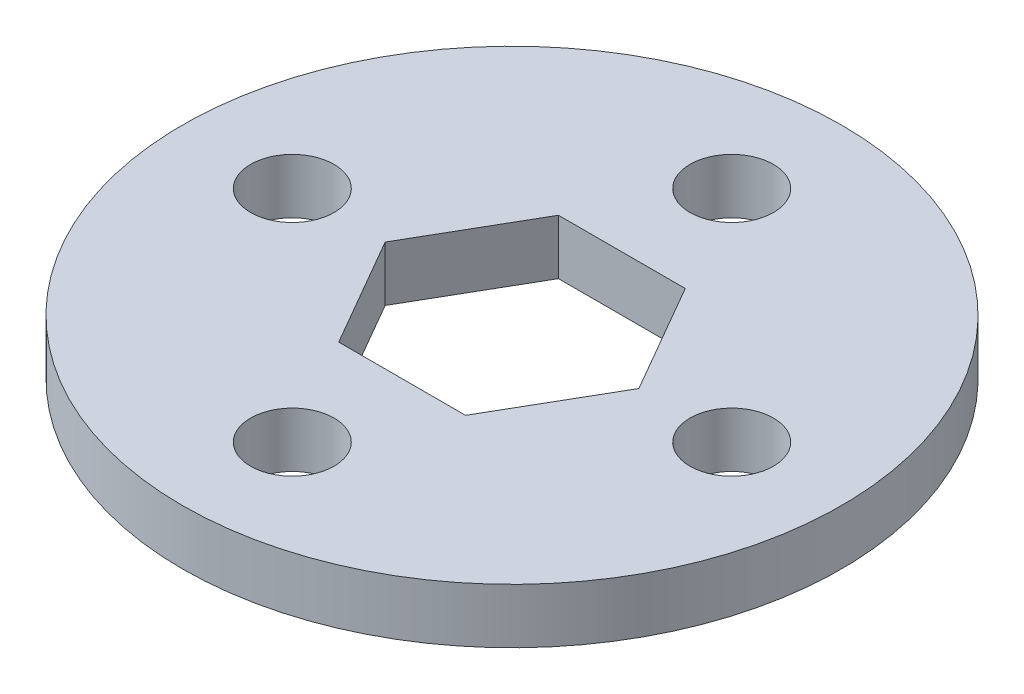
ISO-10303-21;
HEADER;
FILE_DESCRIPTION(('STEP AP214'),'2;1');
FILE_NAME('part.step','',(''),(''),'','','');
FILE_SCHEMA(('AUTOMOTIVE_DESIGN { 1 0 10303 214 1 1 1 1 }'));
ENDSEC;
DATA;
#1=APPLICATION_CONTEXT('core data for automotive mechanical design processes');
#2=APPLICATION_PROTOCOL_DEFINITION('international standard','automotive_design',2000,#1);
#3=PRODUCT_CONTEXT('',#1,'mechanical');
#4=PRODUCT('Part','Part','',(#3));
#5=PRODUCT_RELATED_PRODUCT_CATEGORY('part','',(#4));
#6=PRODUCT_DEFINITION_FORMATION('','',#4);
#7=PRODUCT_DEFINITION_CONTEXT('part definition',#1,'design');
#8=PRODUCT_DEFINITION('design','',#6,#7);
#9=PRODUCT_DEFINITION_SHAPE('','',#8);
#10=(LENGTH_UNIT() NAMED_UNIT(*) SI_UNIT(.MILLI.,.METRE.));
#11=(NAMED_UNIT(*) PLANE_ANGLE_UNIT() SI_UNIT($,.RADIAN.));
#12=(NAMED_UNIT(*) SI_UNIT($,.STERADIAN.) SOLID_ANGLE_UNIT());
#13=UNCERTAINTY_MEASURE_WITH_UNIT(LENGTH_MEASURE(1.E-05),#10,'distance_accuracy_value','');
#14=(GEOMETRIC_REPRESENTATION_CONTEXT(3) GLOBAL_UNCERTAINTY_ASSIGNED_CONTEXT((#13)) GLOBAL_UNIT_ASSIGNED_CONTEXT((#10,
#11,#12)) REPRESENTATION_CONTEXT('',''));
#15=CARTESIAN_POINT('',(0.,0.,0.));
#16=DIRECTION('',(0.,0.,1.));
#17=DIRECTION('',(1.,0.,0.));
#18=AXIS2_PLACEMENT_3D('',#15,#16,#17);
#19=CARTESIAN_POINT('',(0.,3.175,0.));
#20=DIRECTION('',(0.,1.,0.));
#21=DIRECTION('',(0.,0.,1.));
#22=AXIS2_PLACEMENT_3D('',#19,#20,#21);
#23=PLANE('',#22);
#24=CARTESIAN_POINT('',(8.95913809847724E-13,3.175,12.7));
#25=DIRECTION('',(0.,1.,0.));
#26=DIRECTION('',(0.,0.,1.));
#27=AXIS2_PLACEMENT_3D('',#24,#25,#26);
#28=CIRCLE('',#27,2.413);
#29=CARTESIAN_POINT('',(8.95913809847724E-13,3.175,15.113));
#30=VERTEX_POINT('',#29);
#31=EDGE_CURVE('E285',#30,#30,#28,.T.);
#32=ORIENTED_EDGE('',*,*,#31,.F.);
#33=EDGE_LOOP('',(#32));
#34=FACE_BOUND('',#33,.T.);
#35=CARTESIAN_POINT('',(0.,3.175,-12.7));
#36=DIRECTION('',(0.,1.,0.));
#37=DIRECTION('',(0.,0.,1.));
#38=AXIS2_PLACEMENT_3D('',#35,#36,#37);
#39=CIRCLE('',#38,2.413);
#40=CARTESIAN_POINT('',(0.,3.175,-10.287));
#41=VERTEX_POINT('',#40);
#42=EDGE_CURVE('E134',#41,#41,#39,.T.);
#43=ORIENTED_EDGE('',*,*,#42,.F.);
#44=EDGE_LOOP('',(#43));
#45=FACE_BOUND('',#44,.T.);
#46=CARTESIAN_POINT('',(0.,3.175,0.));
#47=DIRECTION('',(0.,1.,0.));
#48=DIRECTION('',(0.,0.,1.));
#49=AXIS2_PLACEMENT_3D('',#46,#47,#48);
#50=CIRCLE('',#49,19.05);
#51=CARTESIAN_POINT('',(0.,3.175,19.05));
#52=VERTEX_POINT('',#51);
#53=EDGE_CURVE('E11',#52,#52,#50,.T.);
#54=ORIENTED_EDGE('',*,*,#53,.T.);
#55=EDGE_LOOP('',(#54));
#56=FACE_BOUND('',#55,.T.);
#57=DIRECTION('',(0.500000000000001,0.,0.866025403784438));
#58=VECTOR('',#57,1.);
#59=CARTESIAN_POINT('',(-7.33234841870825,3.175,0.));
#60=LINE('',#59,#58);
#61=CARTESIAN_POINT('',(-7.33234841870825,3.175,0.));
#62=VERTEX_POINT('',#61);
#63=CARTESIAN_POINT('',(-3.66617420935411,3.175,6.35000000000001));
#64=VERTEX_POINT('',#63);
#65=EDGE_CURVE('E102',#62,#64,#60,.T.);
#66=ORIENTED_EDGE('',*,*,#65,.F.);
#67=DIRECTION('',(-0.499999999999995,0.,0.866025403784441));
#68=VECTOR('',#67,1.);
#69=CARTESIAN_POINT('',(-3.6661742093542,3.175,-6.34999999999996));
#70=LINE('',#69,#68);
#71=CARTESIAN_POINT('',(-3.6661742093542,3.175,-6.34999999999996));
#72=VERTEX_POINT('',#71);
#73=EDGE_CURVE('E93',#72,#62,#70,.T.);
#74=ORIENTED_EDGE('',*,*,#73,.F.);
#75=DIRECTION('',(-1.,0.,0.));
#76=VECTOR('',#75,1.);
#77=CARTESIAN_POINT('',(3.66617420935407,3.175,-6.35000000000004));
#78=LINE('',#77,#76);
#79=CARTESIAN_POINT('',(3.66617420935407,3.175,-6.35000000000004));
#80=VERTEX_POINT('',#79);
#81=EDGE_CURVE('E129',#80,#72,#78,.T.);
#82=ORIENTED_EDGE('',*,*,#81,.F.);
#83=DIRECTION('',(-0.500000000000007,0.,-0.866025403784435));
#84=VECTOR('',#83,1.);
#85=CARTESIAN_POINT('',(7.33234841870825,3.175,0.));
#86=LINE('',#85,#84);
#87=CARTESIAN_POINT('',(7.33234841870825,3.175,0.));
#88=VERTEX_POINT('',#87);
#89=EDGE_CURVE('E126',#88,#80,#86,.T.);
#90=ORIENTED_EDGE('',*,*,#89,.F.);
#91=DIRECTION('',(0.499999999999995,0.,-0.866025403784442));
#92=VECTOR('',#91,1.);
#93=CARTESIAN_POINT('',(3.66617420935416,3.175,6.34999999999999));
#94=LINE('',#93,#92);
#95=CARTESIAN_POINT('',(3.66617420935416,3.175,6.34999999999999));
#96=VERTEX_POINT('',#95);
#97=EDGE_CURVE('E120',#96,#88,#94,.T.);
#98=ORIENTED_EDGE('',*,*,#97,.F.);
#99=DIRECTION('',(1.,0.,0.));
#100=VECTOR('',#99,1.);
#101=CARTESIAN_POINT('',(-3.66617420935411,3.175,6.35000000000001));
#102=LINE('',#101,#100);
#103=EDGE_CURVE('E116',#64,#96,#102,.T.);
#104=ORIENTED_EDGE('',*,*,#103,.F.);
#105=EDGE_LOOP('',(#66,#74,#82,#90,#98,#104));
#106=FACE_BOUND('',#105,.T.);
#107=CARTESIAN_POINT('',(12.7000000000004,3.175,-4.47179254206403E-13));
#108=DIRECTION('',(0.,1.,0.));
#109=DIRECTION('',(0.,0.,1.));
#110=AXIS2_PLACEMENT_3D('',#107,#108,#109);
#111=CIRCLE('',#110,2.413);
#112=CARTESIAN_POINT('',(12.7000000000004,3.175,2.41299999999955));
#113=VERTEX_POINT('',#112);
#114=EDGE_CURVE('E293',#113,#113,#111,.T.);
#115=ORIENTED_EDGE('',*,*,#114,.F.);
#116=EDGE_LOOP('',(#115));
#117=FACE_BOUND('',#116,.T.);
#118=CARTESIAN_POINT('',(-12.6999999999996,3.175,4.48734555641321E-13));
#119=DIRECTION('',(0.,1.,0.));
#120=DIRECTION('',(0.,0.,1.));
#121=AXIS2_PLACEMENT_3D('',#118,#119,#120);
#122=CIRCLE('',#121,2.413);
#123=CARTESIAN_POINT('',(-12.6999999999996,3.175,2.41300000000045));
#124=VERTEX_POINT('',#123);
#125=EDGE_CURVE('E274',#124,#124,#122,.T.);
#126=ORIENTED_EDGE('',*,*,#125,.F.);
#127=EDGE_LOOP('',(#126));
#128=FACE_BOUND('',#127,.T.);
#129=ADVANCED_FACE('F39',(#34,#45,#56,#106,#117,#128),#23,.T.);
#130=CARTESIAN_POINT('',(0.,0.,0.));
#131=DIRECTION('',(0.,1.,0.));
#132=DIRECTION('',(0.,0.,1.));
#133=AXIS2_PLACEMENT_3D('',#130,#131,#132);
#134=PLANE('',#133);
#135=CARTESIAN_POINT('',(0.,0.,0.));
#136=DIRECTION('',(0.,1.,0.));
#137=DIRECTION('',(0.,0.,1.));
#138=AXIS2_PLACEMENT_3D('',#135,#136,#137);
#139=CIRCLE('',#138,19.05);
#140=CARTESIAN_POINT('',(0.,0.,19.05));
#141=VERTEX_POINT('',#140);
#142=EDGE_CURVE('E43',#141,#141,#139,.T.);
#143=ORIENTED_EDGE('',*,*,#142,.F.);
#144=EDGE_LOOP('',(#143));
#145=FACE_BOUND('',#144,.T.);
#146=DIRECTION('',(-0.499999999999995,0.,0.866025403784441));
#147=VECTOR('',#146,1.);
#148=CARTESIAN_POINT('',(-3.6661742093542,0.,-6.34999999999996));
#149=LINE('',#148,#147);
#150=CARTESIAN_POINT('',(-3.6661742093542,0.,-6.34999999999996));
#151=VERTEX_POINT('',#150);
#152=CARTESIAN_POINT('',(-7.33234841870825,0.,0.));
#153=VERTEX_POINT('',#152);
#154=EDGE_CURVE('E63',#151,#153,#149,.T.);
#155=ORIENTED_EDGE('',*,*,#154,.T.);
#156=DIRECTION('',(0.500000000000001,0.,0.866025403784438));
#157=VECTOR('',#156,1.);
#158=CARTESIAN_POINT('',(-7.33234841870825,0.,0.));
#159=LINE('',#158,#157);
#160=CARTESIAN_POINT('',(-3.66617420935411,0.,6.35000000000001));
#161=VERTEX_POINT('',#160);
#162=EDGE_CURVE('E109',#153,#161,#159,.T.);
#163=ORIENTED_EDGE('',*,*,#162,.T.);
#164=DIRECTION('',(1.,0.,0.));
#165=VECTOR('',#164,1.);
#166=CARTESIAN_POINT('',(-3.66617420935411,0.,6.35000000000001));
#167=LINE('',#166,#165);
#168=CARTESIAN_POINT('',(3.66617420935416,0.,6.34999999999999));
#169=VERTEX_POINT('',#168);
#170=EDGE_CURVE('E137',#161,#169,#167,.T.);
#171=ORIENTED_EDGE('',*,*,#170,.T.);
#172=DIRECTION('',(0.499999999999995,0.,-0.866025403784442));
#173=VECTOR('',#172,1.);
#174=CARTESIAN_POINT('',(3.66617420935416,0.,6.34999999999999));
#175=LINE('',#174,#173);
#176=CARTESIAN_POINT('',(7.33234841870825,0.,0.));
#177=VERTEX_POINT('',#176);
#178=EDGE_CURVE('E141',#169,#177,#175,.T.);
#179=ORIENTED_EDGE('',*,*,#178,.T.);
#180=DIRECTION('',(-0.500000000000007,0.,-0.866025403784435));
#181=VECTOR('',#180,1.);
#182=CARTESIAN_POINT('',(7.33234841870825,0.,0.));
#183=LINE('',#182,#181);
#184=CARTESIAN_POINT('',(3.66617420935407,0.,-6.35000000000004));
#185=VERTEX_POINT('',#184);
#186=EDGE_CURVE('E145',#177,#185,#183,.T.);
#187=ORIENTED_EDGE('',*,*,#186,.T.);
#188=DIRECTION('',(-1.,0.,0.));
#189=VECTOR('',#188,1.);
#190=CARTESIAN_POINT('',(3.66617420935407,0.,-6.35000000000004));
#191=LINE('',#190,#189);
#192=EDGE_CURVE('E103',#185,#151,#191,.T.);
#193=ORIENTED_EDGE('',*,*,#192,.T.);
#194=EDGE_LOOP('',(#155,#163,#171,#179,#187,#193));
#195=FACE_BOUND('',#194,.T.);
#196=CARTESIAN_POINT('',(0.,0.,-12.7));
#197=DIRECTION('',(0.,1.,0.));
#198=DIRECTION('',(0.,0.,1.));
#199=AXIS2_PLACEMENT_3D('',#196,#197,#198);
#200=CIRCLE('',#199,2.413);
#201=CARTESIAN_POINT('',(0.,0.,-10.287));
#202=VERTEX_POINT('',#201);
#203=EDGE_CURVE('E297',#202,#202,#200,.T.);
#204=ORIENTED_EDGE('',*,*,#203,.T.);
#205=EDGE_LOOP('',(#204));
#206=FACE_BOUND('',#205,.T.);
#207=CARTESIAN_POINT('',(12.7000000000004,0.,-4.47179254206403E-13));
#208=DIRECTION('',(0.,1.,0.));
#209=DIRECTION('',(0.,0.,1.));
#210=AXIS2_PLACEMENT_3D('',#207,#208,#209);
#211=CIRCLE('',#210,2.413);
#212=CARTESIAN_POINT('',(12.7000000000004,0.,2.41299999999955));
#213=VERTEX_POINT('',#212);
#214=EDGE_CURVE('E289',#213,#213,#211,.T.);
#215=ORIENTED_EDGE('',*,*,#214,.T.);
#216=EDGE_LOOP('',(#215));
#217=FACE_BOUND('',#216,.T.);
#218=CARTESIAN_POINT('',(8.95913809847724E-13,0.,12.7));
#219=DIRECTION('',(0.,1.,0.));
#220=DIRECTION('',(0.,0.,1.));
#221=AXIS2_PLACEMENT_3D('',#218,#219,#220);
#222=CIRCLE('',#221,2.413);
#223=CARTESIAN_POINT('',(8.95913809847724E-13,0.,15.113));
#224=VERTEX_POINT('',#223);
#225=EDGE_CURVE('E282',#224,#224,#222,.T.);
#226=ORIENTED_EDGE('',*,*,#225,.T.);
#227=EDGE_LOOP('',(#226));
#228=FACE_BOUND('',#227,.T.);
#229=CARTESIAN_POINT('',(-12.6999999999996,0.,4.48734555641321E-13));
#230=DIRECTION('',(0.,1.,0.));
#231=DIRECTION('',(0.,0.,1.));
#232=AXIS2_PLACEMENT_3D('',#229,#230,#231);
#233=CIRCLE('',#232,2.413);
#234=CARTESIAN_POINT('',(-12.6999999999996,0.,2.41300000000045));
#235=VERTEX_POINT('',#234);
#236=EDGE_CURVE('E277',#235,#235,#233,.T.);
#237=ORIENTED_EDGE('',*,*,#236,.T.);
#238=EDGE_LOOP('',(#237));
#239=FACE_BOUND('',#238,.T.);
#240=ADVANCED_FACE('F169',(#145,#195,#206,#217,#228,#239),#134,.F.);
#241=CARTESIAN_POINT('',(0.,3.175,0.));
#242=DIRECTION('',(0.,-1.,0.));
#243=DIRECTION('',(0.,0.,-1.));
#244=AXIS2_PLACEMENT_3D('',#241,#242,#243);
#245=CYLINDRICAL_SURFACE('',#244,19.05);
#246=ORIENTED_EDGE('',*,*,#53,.F.);
#247=EDGE_LOOP('',(#246));
#248=FACE_BOUND('',#247,.T.);
#249=ORIENTED_EDGE('',*,*,#142,.T.);
#250=EDGE_LOOP('',(#249));
#251=FACE_BOUND('',#250,.T.);
#252=ADVANCED_FACE('F41',(#248,#251),#245,.T.);
#253=CARTESIAN_POINT('',(-3.6661742093542,3.175,-6.34999999999996));
#254=DIRECTION('',(0.866025403784441,0.,0.499999999999995));
#255=DIRECTION('',(0.499999999999995,0.,-0.866025403784441));
#256=AXIS2_PLACEMENT_3D('',#253,#254,#255);
#257=PLANE('',#256);
#258=ORIENTED_EDGE('',*,*,#154,.F.);
#259=DIRECTION('',(0.,-1.,0.));
#260=VECTOR('',#259,1.);
#261=CARTESIAN_POINT('',(-3.6661742093542,3.175,-6.34999999999996));
#262=LINE('',#261,#260);
#263=EDGE_CURVE('E97',#72,#151,#262,.T.);
#264=ORIENTED_EDGE('',*,*,#263,.F.);
#265=ORIENTED_EDGE('',*,*,#73,.T.);
#266=DIRECTION('',(0.,-1.,0.));
#267=VECTOR('',#266,1.);
#268=CARTESIAN_POINT('',(-7.33234841870825,3.175,0.));
#269=LINE('',#268,#267);
#270=EDGE_CURVE('E96',#62,#153,#269,.T.);
#271=ORIENTED_EDGE('',*,*,#270,.T.);
#272=EDGE_LOOP('',(#258,#264,#265,#271));
#273=FACE_BOUND('',#272,.T.);
#274=ADVANCED_FACE('F95',(#273),#257,.T.);
#275=CARTESIAN_POINT('',(-7.33234841870825,3.175,0.));
#276=DIRECTION('',(0.866025403784438,0.,-0.500000000000001));
#277=DIRECTION('',(-0.500000000000001,0.,-0.866025403784438));
#278=AXIS2_PLACEMENT_3D('',#275,#276,#277);
#279=PLANE('',#278);
#280=ORIENTED_EDGE('',*,*,#162,.F.);
#281=ORIENTED_EDGE('',*,*,#270,.F.);
#282=ORIENTED_EDGE('',*,*,#65,.T.);
#283=DIRECTION('',(0.,-1.,0.));
#284=VECTOR('',#283,1.);
#285=CARTESIAN_POINT('',(-3.66617420935411,3.175,6.35000000000001));
#286=LINE('',#285,#284);
#287=EDGE_CURVE('E111',#64,#161,#286,.T.);
#288=ORIENTED_EDGE('',*,*,#287,.T.);
#289=EDGE_LOOP('',(#280,#281,#282,#288));
#290=FACE_BOUND('',#289,.T.);
#291=ADVANCED_FACE('F106',(#290),#279,.T.);
#292=CARTESIAN_POINT('',(-3.66617420935411,3.175,6.35000000000001));
#293=DIRECTION('',(0.,0.,-1.));
#294=DIRECTION('',(-1.,0.,0.));
#295=AXIS2_PLACEMENT_3D('',#292,#293,#294);
#296=PLANE('',#295);
#297=ORIENTED_EDGE('',*,*,#170,.F.);
#298=ORIENTED_EDGE('',*,*,#287,.F.);
#299=ORIENTED_EDGE('',*,*,#103,.T.);
#300=DIRECTION('',(0.,-1.,0.));
#301=VECTOR('',#300,1.);
#302=CARTESIAN_POINT('',(3.66617420935416,3.175,6.34999999999999));
#303=LINE('',#302,#301);
#304=EDGE_CURVE('E159',#96,#169,#303,.T.);
#305=ORIENTED_EDGE('',*,*,#304,.T.);
#306=EDGE_LOOP('',(#297,#298,#299,#305));
#307=FACE_BOUND('',#306,.T.);
#308=ADVANCED_FACE('F165',(#307),#296,.T.);
#309=CARTESIAN_POINT('',(3.66617420935416,3.175,6.34999999999999));
#310=DIRECTION('',(-0.866025403784441,0.,-0.499999999999995));
#311=DIRECTION('',(-0.499999999999995,0.,0.866025403784442));
#312=AXIS2_PLACEMENT_3D('',#309,#310,#311);
#313=PLANE('',#312);
#314=ORIENTED_EDGE('',*,*,#178,.F.);
#315=ORIENTED_EDGE('',*,*,#304,.F.);
#316=ORIENTED_EDGE('',*,*,#97,.T.);
#317=DIRECTION('',(0.,-1.,0.));
#318=VECTOR('',#317,1.);
#319=CARTESIAN_POINT('',(7.33234841870825,3.175,0.));
#320=LINE('',#319,#318);
#321=EDGE_CURVE('E156',#88,#177,#320,.T.);
#322=ORIENTED_EDGE('',*,*,#321,.T.);
#323=EDGE_LOOP('',(#314,#315,#316,#322));
#324=FACE_BOUND('',#323,.T.);
#325=ADVANCED_FACE('F178',(#324),#313,.T.);
#326=CARTESIAN_POINT('',(7.33234841870825,3.175,0.));
#327=DIRECTION('',(-0.866025403784434,0.,0.500000000000007));
#328=DIRECTION('',(0.500000000000007,0.,0.866025403784435));
#329=AXIS2_PLACEMENT_3D('',#326,#327,#328);
#330=PLANE('',#329);
#331=ORIENTED_EDGE('',*,*,#186,.F.);
#332=ORIENTED_EDGE('',*,*,#321,.F.);
#333=ORIENTED_EDGE('',*,*,#89,.T.);
#334=DIRECTION('',(0.,-1.,0.));
#335=VECTOR('',#334,1.);
#336=CARTESIAN_POINT('',(3.66617420935407,3.175,-6.35000000000004));
#337=LINE('',#336,#335);
#338=EDGE_CURVE('E55',#80,#185,#337,.T.);
#339=ORIENTED_EDGE('',*,*,#338,.T.);
#340=EDGE_LOOP('',(#331,#332,#333,#339));
#341=FACE_BOUND('',#340,.T.);
#342=ADVANCED_FACE('F176',(#341),#330,.T.);
#343=CARTESIAN_POINT('',(3.66617420935407,3.175,-6.35000000000004));
#344=DIRECTION('',(0.,0.,1.));
#345=DIRECTION('',(1.,0.,0.));
#346=AXIS2_PLACEMENT_3D('',#343,#344,#345);
#347=PLANE('',#346);
#348=ORIENTED_EDGE('',*,*,#192,.F.);
#349=ORIENTED_EDGE('',*,*,#338,.F.);
#350=ORIENTED_EDGE('',*,*,#81,.T.);
#351=ORIENTED_EDGE('',*,*,#263,.T.);
#352=EDGE_LOOP('',(#348,#349,#350,#351));
#353=FACE_BOUND('',#352,.T.);
#354=ADVANCED_FACE('F172',(#353),#347,.T.);
#355=CARTESIAN_POINT('',(0.,3.175,-12.7));
#356=DIRECTION('',(0.,-1.,0.));
#357=DIRECTION('',(0.,0.,-1.));
#358=AXIS2_PLACEMENT_3D('',#355,#356,#357);
#359=CYLINDRICAL_SURFACE('',#358,2.413);
#360=ORIENTED_EDGE('',*,*,#42,.T.);
#361=EDGE_LOOP('',(#360));
#362=FACE_BOUND('',#361,.T.);
#363=ORIENTED_EDGE('',*,*,#203,.F.);
#364=EDGE_LOOP('',(#363));
#365=FACE_BOUND('',#364,.T.);
#366=ADVANCED_FACE('F228',(#362,#365),#359,.F.);
#367=CARTESIAN_POINT('',(12.7000000000004,3.175,-4.47179254206403E-13));
#368=DIRECTION('',(0.,-1.,0.));
#369=DIRECTION('',(0.,0.,-1.));
#370=AXIS2_PLACEMENT_3D('',#367,#368,#369);
#371=CYLINDRICAL_SURFACE('',#370,2.413);
#372=ORIENTED_EDGE('',*,*,#114,.T.);
#373=EDGE_LOOP('',(#372));
#374=FACE_BOUND('',#373,.T.);
#375=ORIENTED_EDGE('',*,*,#214,.F.);
#376=EDGE_LOOP('',(#375));
#377=FACE_BOUND('',#376,.T.);
#378=ADVANCED_FACE('F237',(#374,#377),#371,.F.);
#379=CARTESIAN_POINT('',(8.95913809847724E-13,3.175,12.7));
#380=DIRECTION('',(0.,-1.,0.));
#381=DIRECTION('',(0.,0.,-1.));
#382=AXIS2_PLACEMENT_3D('',#379,#380,#381);
#383=CYLINDRICAL_SURFACE('',#382,2.413);
#384=ORIENTED_EDGE('',*,*,#31,.T.);
#385=EDGE_LOOP('',(#384));
#386=FACE_BOUND('',#385,.T.);
#387=ORIENTED_EDGE('',*,*,#225,.F.);
#388=EDGE_LOOP('',(#387));
#389=FACE_BOUND('',#388,.T.);
#390=ADVANCED_FACE('F247',(#386,#389),#383,.F.);
#391=CARTESIAN_POINT('',(-12.6999999999996,3.175,4.48734555641321E-13));
#392=DIRECTION('',(0.,-1.,0.));
#393=DIRECTION('',(0.,0.,-1.));
#394=AXIS2_PLACEMENT_3D('',#391,#392,#393);
#395=CYLINDRICAL_SURFACE('',#394,2.413);
#396=ORIENTED_EDGE('',*,*,#125,.T.);
#397=EDGE_LOOP('',(#396));
#398=FACE_BOUND('',#397,.T.);
#399=ORIENTED_EDGE('',*,*,#236,.F.);
#400=EDGE_LOOP('',(#399));
#401=FACE_BOUND('',#400,.T.);
#402=ADVANCED_FACE('F257',(#398,#401),#395,.F.);
#403=CLOSED_SHELL('',(#129,#240,#252,#274,#291,#308,#325,#342,#354,#366,#378,#390,#402));
#404=MANIFOLD_SOLID_BREP('B2',#403);
#405=ADVANCED_BREP_SHAPE_REPRESENTATION('',(#18,#404),#14);
#406=SHAPE_DEFINITION_REPRESENTATION(#9,#405);
ENDSEC;
END-ISO-10303-21;
